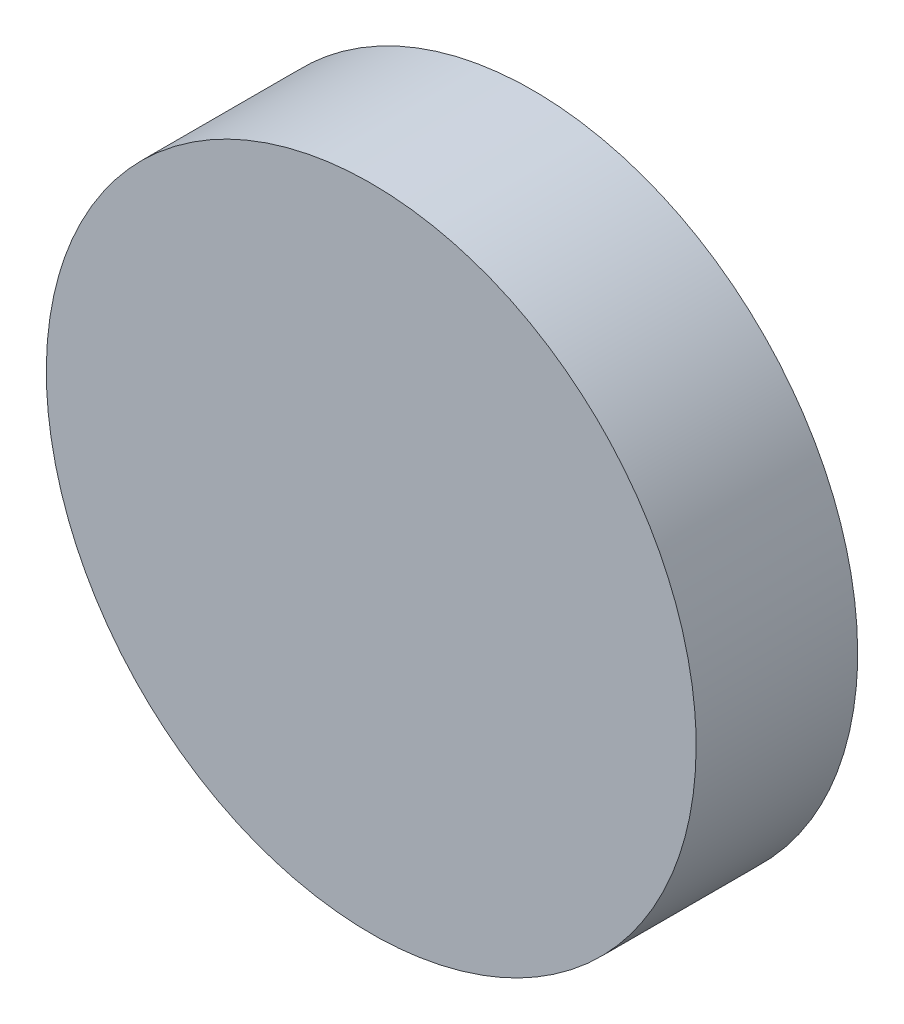
ISO-10303-21;
HEADER;
FILE_DESCRIPTION(('STEP AP214'),'2;1');
FILE_NAME('part.step','',(''),(''),'','','');
FILE_SCHEMA(('AUTOMOTIVE_DESIGN { 1 0 10303 214 1 1 1 1 }'));
ENDSEC;
DATA;
#1=APPLICATION_CONTEXT('core data for automotive mechanical design processes');
#2=APPLICATION_PROTOCOL_DEFINITION('international standard','automotive_design',2000,#1);
#3=PRODUCT_CONTEXT('',#1,'mechanical');
#4=PRODUCT('Part','Part','',(#3));
#5=PRODUCT_RELATED_PRODUCT_CATEGORY('part','',(#4));
#6=PRODUCT_DEFINITION_FORMATION('','',#4);
#7=PRODUCT_DEFINITION_CONTEXT('part definition',#1,'design');
#8=PRODUCT_DEFINITION('design','',#6,#7);
#9=PRODUCT_DEFINITION_SHAPE('','',#8);
#10=(LENGTH_UNIT() NAMED_UNIT(*) SI_UNIT(.MILLI.,.METRE.));
#11=(NAMED_UNIT(*) PLANE_ANGLE_UNIT() SI_UNIT($,.RADIAN.));
#12=(NAMED_UNIT(*) SI_UNIT($,.STERADIAN.) SOLID_ANGLE_UNIT());
#13=UNCERTAINTY_MEASURE_WITH_UNIT(LENGTH_MEASURE(1.E-05),#10,'distance_accuracy_value','');
#14=(GEOMETRIC_REPRESENTATION_CONTEXT(3) GLOBAL_UNCERTAINTY_ASSIGNED_CONTEXT((#13)) GLOBAL_UNIT_ASSIGNED_CONTEXT((#10,
#11,#12)) REPRESENTATION_CONTEXT('',''));
#15=CARTESIAN_POINT('',(0.,0.,0.));
#16=DIRECTION('',(0.,0.,1.));
#17=DIRECTION('',(1.,0.,0.));
#18=AXIS2_PLACEMENT_3D('',#15,#16,#17);
#19=CARTESIAN_POINT('',(15.3503636056791,-25.6015554934087,33.9766497664763));
#20=CARTESIAN_POINT('',(15.3503636056791,-25.3323875266763,33.9766497664763));
#21=CARTESIAN_POINT('',(15.2432819307081,-24.7940515932114,33.9766497664762));
#22=CARTESIAN_POINT('',(14.7858677148132,-24.109482841778,33.9766497664763));
#23=CARTESIAN_POINT('',(14.1012989633798,-23.6520686258831,33.9766497664763));
#24=CARTESIAN_POINT('',(13.2937950631825,-23.4914461134265,33.9766497664763));
#25=CARTESIAN_POINT('',(12.4862911629851,-23.6520686258831,33.9766497664763));
#26=CARTESIAN_POINT('',(11.8017224115517,-24.109482841778,33.9766497664763));
#27=CARTESIAN_POINT('',(11.3443081956568,-24.7940515932114,33.9766497664763));
#28=CARTESIAN_POINT('',(11.1836856832003,-25.6015554934087,33.9766497664763));
#29=CARTESIAN_POINT('',(11.3443081956568,-26.4090593936061,33.9766497664763));
#30=CARTESIAN_POINT('',(11.8017224115517,-27.0936281450395,33.9766497664763));
#31=CARTESIAN_POINT('',(12.4862911629851,-27.5510423609344,33.9766497664763));
#32=CARTESIAN_POINT('',(13.2937950631825,-27.7116648733909,33.9766497664763));
#33=CARTESIAN_POINT('',(14.1012989633798,-27.5510423609344,33.9766497664763));
#34=CARTESIAN_POINT('',(14.7858677148132,-27.0936281450395,33.9766497664763));
#35=CARTESIAN_POINT('',(15.2432819307081,-26.4090593936061,33.9766497664763));
#36=CARTESIAN_POINT('',(15.3503636056791,-25.8707234601412,33.9766497664763));
#37=CARTESIAN_POINT('',(15.3503636056791,-25.6015554934087,33.9766497664763));
#38=B_SPLINE_CURVE_WITH_KNOTS('',3,(#19,#20,#21,#22,#23,#24,#25,#26,#27,#28,#29,#30,#31,#32,#33,
#34,#35,#36,#37),.UNSPECIFIED.,.T.,.F.,(4,1,1,1,1,1,1,1,1,1,1,1,1,1,1,1,4),(0.,0.0625,0.125,
0.1875,0.25,0.3125,0.375,0.4375,0.5,0.5625,0.625,0.6875,0.75,0.8125,0.875,0.9375,1.),.UNSPECIFIED.);
#39=DIRECTION('',(0.,0.,1.));
#40=VECTOR('',#39,1.);
#41=SURFACE_OF_LINEAR_EXTRUSION('',#38,#40);
#42=CARTESIAN_POINT('',(15.3503636056791,-25.6015554934087,33.9766497664763));
#43=CARTESIAN_POINT('',(15.3503636056791,-25.3323875266763,33.9766497664763));
#44=CARTESIAN_POINT('',(15.2432819307081,-24.7940515932114,33.9766497664763));
#45=CARTESIAN_POINT('',(14.7858677148132,-24.109482841778,33.9766497664763));
#46=CARTESIAN_POINT('',(14.1012989633798,-23.6520686258831,33.9766497664763));
#47=CARTESIAN_POINT('',(13.2937950631825,-23.4914461134265,33.9766497664763));
#48=CARTESIAN_POINT('',(12.4862911629851,-23.6520686258831,33.9766497664763));
#49=CARTESIAN_POINT('',(11.8017224115517,-24.109482841778,33.9766497664763));
#50=CARTESIAN_POINT('',(11.3443081956568,-24.7940515932114,33.9766497664763));
#51=CARTESIAN_POINT('',(11.1836856832003,-25.6015554934087,33.9766497664763));
#52=CARTESIAN_POINT('',(11.3443081956568,-26.4090593936061,33.9766497664763));
#53=CARTESIAN_POINT('',(11.8017224115517,-27.0936281450395,33.9766497664763));
#54=CARTESIAN_POINT('',(12.4862911629851,-27.5510423609344,33.9766497664763));
#55=CARTESIAN_POINT('',(13.2937950631825,-27.7116648733909,33.9766497664763));
#56=CARTESIAN_POINT('',(14.1012989633798,-27.5510423609344,33.9766497664763));
#57=CARTESIAN_POINT('',(14.7858677148132,-27.0936281450395,33.9766497664763));
#58=CARTESIAN_POINT('',(15.2432819307081,-26.4090593936061,33.9766497664763));
#59=CARTESIAN_POINT('',(15.3503636056791,-25.8707234601412,33.9766497664763));
#60=CARTESIAN_POINT('',(15.3503636056791,-25.6015554934087,33.9766497664763));
#61=B_SPLINE_CURVE_WITH_KNOTS('',3,(#42,#43,#44,#45,#46,#47,#48,#49,#50,#51,#52,#53,#54,#55,#56,
#57,#58,#59,#60),.UNSPECIFIED.,.T.,.F.,(4,1,1,1,1,1,1,1,1,1,1,1,1,1,1,1,4),(0.,0.0625,0.125,
0.1875,0.25,0.3125,0.375,0.4375,0.5,0.5625,0.625,0.6875,0.75,0.8125,0.875,0.9375,1.),.UNSPECIFIED.);
#62=CARTESIAN_POINT('',(15.3503636056791,-25.6015554934087,33.9766497664763));
#63=VERTEX_POINT('',#62);
#64=EDGE_CURVE('E9',#63,#63,#61,.T.);
#65=ORIENTED_EDGE('',*,*,#64,.T.);
#66=EDGE_LOOP('',(#65));
#67=FACE_BOUND('',#66,.T.);
#68=CARTESIAN_POINT('',(15.3503636056791,-25.6015554934087,34.9990000000068));
#69=CARTESIAN_POINT('',(15.3503636300379,-25.6352022831517,34.9990000000068));
#70=CARTESIAN_POINT('',(15.3495269935284,-25.6688483745142,34.9990000000068));
#71=CARTESIAN_POINT('',(15.346196586481,-25.7360605285312,34.9990000000068));
#72=CARTESIAN_POINT('',(15.3437027184522,-25.7696265863609,34.9990000000068));
#73=CARTESIAN_POINT('',(15.3370738124356,-25.8365983613763,34.9990000000068));
#74=CARTESIAN_POINT('',(15.3329386618263,-25.8700040673998,34.9990000000068));
#75=CARTESIAN_POINT('',(15.323043098035,-25.9365753108456,34.9990000000068));
#76=CARTESIAN_POINT('',(15.3172826147575,-25.9697408378466,34.9990000000068));
#77=CARTESIAN_POINT('',(15.3041522287672,-26.0357517513031,34.9990000000068));
#78=CARTESIAN_POINT('',(15.2967823260544,-26.0685971377587,34.9990000000068));
#79=CARTESIAN_POINT('',(15.2804489160935,-26.1338878282125,34.9990000000068));
#80=CARTESIAN_POINT('',(15.2714854775938,-26.1663331494057,34.9990000000068));
#81=CARTESIAN_POINT('',(15.2519808248614,-26.2307437222432,34.9990000000068));
#82=CARTESIAN_POINT('',(15.241439718946,-26.2627090066795,34.9990000000068));
#83=CARTESIAN_POINT('',(15.218795541295,-26.3260796262804,34.9990000000068));
#84=CARTESIAN_POINT('',(15.2066925614854,-26.3574849942758,34.9990000000068));
#85=CARTESIAN_POINT('',(15.180940732118,-26.4196554100151,34.9990000000068));
#86=CARTESIAN_POINT('',(15.1672918825602,-26.4504204577589,34.9990000000068));
#87=CARTESIAN_POINT('',(15.1384939392235,-26.5112421042255,34.9990000000068));
#88=CARTESIAN_POINT('',(15.1233447572282,-26.5412986611616,34.9990000000068));
#89=CARTESIAN_POINT('',(15.0915914768304,-26.6006356860102,34.9990000000068));
#90=CARTESIAN_POINT('',(15.0749872786485,-26.6299161005181,34.9990000000068));
#91=CARTESIAN_POINT('',(15.0403692527882,-26.6876330561693,34.9990000000068));
#92=CARTESIAN_POINT('',(15.0223553643385,-26.716069560859,34.9990000000068));
#93=CARTESIAN_POINT('',(14.9849631878921,-26.7720309076073,34.9990000000068));
#94=CARTESIAN_POINT('',(14.9655848998955,-26.799555749666,34.9990000000068));
#95=CARTESIAN_POINT('',(14.925509130848,-26.8536259579087,34.9990000000068));
#96=CARTESIAN_POINT('',(14.9048117067321,-26.8801713662879,34.9990000000068));
#97=CARTESIAN_POINT('',(14.8621428982873,-26.9322148684723,34.9990000000068));
#98=CARTESIAN_POINT('',(14.8401716014817,-26.9577130340248,34.9990000000068));
#99=CARTESIAN_POINT('',(14.7950002229733,-27.0075943008858,34.9990000000068));
#100=CARTESIAN_POINT('',(14.7718002136353,-27.0319774677046,34.9990000000068));
#101=CARTESIAN_POINT('',(14.7242170374783,-27.0795606438615,34.9990000000068));
#102=CARTESIAN_POINT('',(14.6998338706595,-27.1027606531996,34.9990000000068));
#103=CARTESIAN_POINT('',(14.6499526037985,-27.147932031708,34.9990000000068));
#104=CARTESIAN_POINT('',(14.624454438246,-27.1699033285136,34.9990000000068));
#105=CARTESIAN_POINT('',(14.5724109360616,-27.2125721369584,34.9990000000068));
#106=CARTESIAN_POINT('',(14.5458655276824,-27.2332695610743,34.9990000000068));
#107=CARTESIAN_POINT('',(14.4917953194397,-27.2733453301218,34.9990000000068));
#108=CARTESIAN_POINT('',(14.464270477381,-27.2927236181184,34.9990000000068));
#109=CARTESIAN_POINT('',(14.4083091306328,-27.3301157945648,34.9990000000068));
#110=CARTESIAN_POINT('',(14.3798726259432,-27.3481296830145,34.9990000000068));
#111=CARTESIAN_POINT('',(14.3221556702916,-27.3827477088748,34.9990000000068));
#112=CARTESIAN_POINT('',(14.2928752557831,-27.3993519070567,34.9990000000068));
#113=CARTESIAN_POINT('',(14.2335382309361,-27.4311051874545,34.9990000000068));
#114=CARTESIAN_POINT('',(14.2034816740021,-27.4462543694499,34.9990000000068));
#115=CARTESIAN_POINT('',(14.1426600275298,-27.4750523127863,34.9990000000068));
#116=CARTESIAN_POINT('',(14.1118949797781,-27.4887011623436,34.9990000000068));
#117=CARTESIAN_POINT('',(14.0497245640602,-27.5144529917123,34.9990000000068));
#118=CARTESIAN_POINT('',(14.0183191960941,-27.5265559715237,34.9990000000068));
#119=CARTESIAN_POINT('',(13.9549485764132,-27.5492001491698,34.9990000000068));
#120=CARTESIAN_POINT('',(13.9229832918677,-27.5597412550786,34.9990000000068));
#121=CARTESIAN_POINT('',(13.8585727193287,-27.5792459078291,34.9990000000068));
#122=CARTESIAN_POINT('',(13.8261273985432,-27.5882093463535,34.9990000000068));
#123=CARTESIAN_POINT('',(13.7608367069754,-27.604542756247,34.9990000000068));
#124=CARTESIAN_POINT('',(13.7279913189978,-27.6119126588679,34.9990000000068));
#125=CARTESIAN_POINT('',(13.6619804096993,-27.6250430451094,34.9990000000068));
#126=CARTESIAN_POINT('',(13.6288148883783,-27.63080352873,34.9990000000068));
#127=CARTESIAN_POINT('',(13.5622436294149,-27.6406990915838,34.9990000000068));
#128=CARTESIAN_POINT('',(13.5288379021952,-27.6448342409127,34.9990000000068));
#129=CARTESIAN_POINT('',(13.4618661850874,-27.6514631504275,34.9990000000068));
#130=CARTESIAN_POINT('',(13.4283002063548,-27.6539570232348,34.9990000000068));
#131=CARTESIAN_POINT('',(13.3610878362444,-27.6572874172275,34.9990000000068));
#132=CARTESIAN_POINT('',(13.3274414497134,-27.6581240359054,34.9990000000068));
#133=CARTESIAN_POINT('',(13.2601486766515,-27.6581240359054,34.9990000000068));
#134=CARTESIAN_POINT('',(13.2265022901205,-27.6572874172276,34.9990000000068));
#135=CARTESIAN_POINT('',(13.1592899200101,-27.6539570232348,34.9990000000068));
#136=CARTESIAN_POINT('',(13.1257239412775,-27.6514631504275,34.9990000000068));
#137=CARTESIAN_POINT('',(13.0587522241697,-27.6448342409127,34.9990000000068));
#138=CARTESIAN_POINT('',(13.02534649695,-27.6406990915838,34.9990000000068));
#139=CARTESIAN_POINT('',(12.9587752379866,-27.63080352873,34.9990000000068));
#140=CARTESIAN_POINT('',(12.9256097166656,-27.6250430451094,34.9990000000068));
#141=CARTESIAN_POINT('',(12.8595988073671,-27.6119126588679,34.9990000000068));
#142=CARTESIAN_POINT('',(12.8267534193895,-27.604542756247,34.9990000000068));
#143=CARTESIAN_POINT('',(12.7614627278217,-27.5882093463535,34.9990000000068));
#144=CARTESIAN_POINT('',(12.7290174070362,-27.5792459078291,34.9990000000068));
#145=CARTESIAN_POINT('',(12.6646068344972,-27.5597412550786,34.9990000000068));
#146=CARTESIAN_POINT('',(12.6326415499517,-27.5492001491698,34.9990000000068));
#147=CARTESIAN_POINT('',(12.5692709302708,-27.5265559715237,34.9990000000068));
#148=CARTESIAN_POINT('',(12.5378655623047,-27.5144529917123,34.9990000000068));
#149=CARTESIAN_POINT('',(12.4756951465868,-27.4887011623436,34.9990000000068));
#150=CARTESIAN_POINT('',(12.4449300988351,-27.4750523127863,34.9990000000068));
#151=CARTESIAN_POINT('',(12.3841084523628,-27.4462543694499,34.9990000000068));
#152=CARTESIAN_POINT('',(12.3540518954288,-27.4311051874545,34.9990000000068));
#153=CARTESIAN_POINT('',(12.2947148705818,-27.3993519070567,34.9990000000068));
#154=CARTESIAN_POINT('',(12.2654344560733,-27.3827477088748,34.9990000000068));
#155=CARTESIAN_POINT('',(12.2077175004217,-27.3481296830145,34.9990000000068));
#156=CARTESIAN_POINT('',(12.1792809957321,-27.3301157945648,34.9990000000068));
#157=CARTESIAN_POINT('',(12.1233196489839,-27.2927236181184,34.9990000000068));
#158=CARTESIAN_POINT('',(12.0957948069252,-27.2733453301217,34.9990000000068));
#159=CARTESIAN_POINT('',(12.0417245986825,-27.2332695610743,34.9990000000068));
#160=CARTESIAN_POINT('',(12.0151791903033,-27.2125721369584,34.9990000000068));
#161=CARTESIAN_POINT('',(11.9631356881189,-27.1699033285136,34.9990000000068));
#162=CARTESIAN_POINT('',(11.9376375225664,-27.147932031708,34.9990000000068));
#163=CARTESIAN_POINT('',(11.8877562557054,-27.1027606531996,34.9990000000068));
#164=CARTESIAN_POINT('',(11.8633730888866,-27.0795606438615,34.9990000000068));
#165=CARTESIAN_POINT('',(11.8157899127297,-27.0319774677046,34.9990000000068));
#166=CARTESIAN_POINT('',(11.7925899033916,-27.0075943008857,34.9990000000068));
#167=CARTESIAN_POINT('',(11.7474185248832,-26.9577130340248,34.9990000000068));
#168=CARTESIAN_POINT('',(11.7254472280776,-26.9322148684723,34.9990000000068));
#169=CARTESIAN_POINT('',(11.6827784196328,-26.8801713662879,34.9990000000068));
#170=CARTESIAN_POINT('',(11.6620809955169,-26.8536259579087,34.9990000000068));
#171=CARTESIAN_POINT('',(11.6220052264694,-26.799555749666,34.9990000000068));
#172=CARTESIAN_POINT('',(11.6026269384728,-26.7720309076073,34.9990000000068));
#173=CARTESIAN_POINT('',(11.5652347620264,-26.716069560859,34.9990000000068));
#174=CARTESIAN_POINT('',(11.5472208735767,-26.6876330561695,34.9990000000068));
#175=CARTESIAN_POINT('',(11.5126028477164,-26.6299161005179,34.9990000000068));
#176=CARTESIAN_POINT('',(11.4959986495345,-26.6006356860094,34.9990000000068));
#177=CARTESIAN_POINT('',(11.4642453691367,-26.5412986611624,34.9990000000068));
#178=CARTESIAN_POINT('',(11.4490961871413,-26.5112421042283,34.9990000000068));
#179=CARTESIAN_POINT('',(11.4202982438049,-26.450420457756,34.9990000000068));
#180=CARTESIAN_POINT('',(11.4066493942476,-26.4196554100043,34.9990000000068));
#181=CARTESIAN_POINT('',(11.3808975648789,-26.3574849942865,34.9990000000068));
#182=CARTESIAN_POINT('',(11.3687945850675,-26.3260796263204,34.9990000000068));
#183=CARTESIAN_POINT('',(11.3461504074214,-26.2627090066395,34.9990000000068));
#184=CARTESIAN_POINT('',(11.3356093015126,-26.2307437220939,34.9990000000068));
#185=CARTESIAN_POINT('',(11.316104648762,-26.1663331495549,34.9990000000068));
#186=CARTESIAN_POINT('',(11.3071412102377,-26.1338878287695,34.9990000000068));
#187=CARTESIAN_POINT('',(11.2908078003441,-26.0685971372016,34.9990000000068));
#188=CARTESIAN_POINT('',(11.2834378977233,-26.0357517492241,34.9990000000068));
#189=CARTESIAN_POINT('',(11.2703075114818,-25.9697408399255,34.9990000000068));
#190=CARTESIAN_POINT('',(11.2645470278612,-25.9365753186046,34.9990000000068));
#191=CARTESIAN_POINT('',(11.2546514650073,-25.8700040596412,34.9990000000068));
#192=CARTESIAN_POINT('',(11.2505163156785,-25.8365983324215,34.9990000000068));
#193=CARTESIAN_POINT('',(11.2438874061636,-25.7696266153137,34.9990000000068));
#194=CARTESIAN_POINT('',(11.2413935333564,-25.7360606365811,34.9990000000068));
#195=CARTESIAN_POINT('',(11.2380631393636,-25.6688482664707,34.9990000000068));
#196=CARTESIAN_POINT('',(11.2372265206858,-25.6352018799397,34.9990000000068));
#197=CARTESIAN_POINT('',(11.2372265206858,-25.5679091068778,34.9990000000068));
#198=CARTESIAN_POINT('',(11.2380631393636,-25.5342627203468,34.9990000000068));
#199=CARTESIAN_POINT('',(11.2413935333564,-25.4670503502364,34.9990000000068));
#200=CARTESIAN_POINT('',(11.2438874061636,-25.4334843715037,34.9990000000068));
#201=CARTESIAN_POINT('',(11.2505163156785,-25.366512654396,34.9990000000068));
#202=CARTESIAN_POINT('',(11.2546514650073,-25.3331069271762,34.9990000000068));
#203=CARTESIAN_POINT('',(11.2645470278612,-25.2665356682129,34.9990000000068));
#204=CARTESIAN_POINT('',(11.2703075114818,-25.2333701468919,34.9990000000068));
#205=CARTESIAN_POINT('',(11.2834378977233,-25.1673592375934,34.9990000000068));
#206=CARTESIAN_POINT('',(11.2908078003441,-25.1345138496158,34.9990000000068));
#207=CARTESIAN_POINT('',(11.3071412102377,-25.069223158048,34.9990000000068));
#208=CARTESIAN_POINT('',(11.316104648762,-25.0367778372625,34.9990000000068));
#209=CARTESIAN_POINT('',(11.3356093015126,-24.9723672647235,34.9990000000068));
#210=CARTESIAN_POINT('',(11.3461504074214,-24.940401980178,34.9990000000068));
#211=CARTESIAN_POINT('',(11.3687945850675,-24.8770313604971,34.9990000000068));
#212=CARTESIAN_POINT('',(11.3808975648789,-24.845625992531,34.9990000000068));
#213=CARTESIAN_POINT('',(11.4066493942476,-24.7834555768131,34.9990000000068));
#214=CARTESIAN_POINT('',(11.4202982438049,-24.7526905290614,34.9990000000068));
#215=CARTESIAN_POINT('',(11.4490961871413,-24.6918688825891,34.9990000000068));
#216=CARTESIAN_POINT('',(11.4642453691367,-24.6618123256551,34.9990000000068));
#217=CARTESIAN_POINT('',(11.4959986495345,-24.6024753008081,34.9990000000068));
#218=CARTESIAN_POINT('',(11.5126028477164,-24.5731948862996,34.9990000000068));
#219=CARTESIAN_POINT('',(11.5472208735767,-24.515477930648,34.9990000000068));
#220=CARTESIAN_POINT('',(11.5652347620264,-24.4870414259584,34.9990000000068));
#221=CARTESIAN_POINT('',(11.6026269384728,-24.4310800792102,34.9990000000068));
#222=CARTESIAN_POINT('',(11.6220052264694,-24.4035552371515,34.9990000000068));
#223=CARTESIAN_POINT('',(11.6620809955169,-24.3494850289088,34.9990000000068));
#224=CARTESIAN_POINT('',(11.6827784196328,-24.3229396205296,34.9990000000068));
#225=CARTESIAN_POINT('',(11.7254472280776,-24.2708961183452,34.9990000000068));
#226=CARTESIAN_POINT('',(11.7474185248832,-24.2453979527927,34.9990000000068));
#227=CARTESIAN_POINT('',(11.7925899033916,-24.1955166859317,34.9990000000068));
#228=CARTESIAN_POINT('',(11.8157899127297,-24.1711335191129,34.9990000000068));
#229=CARTESIAN_POINT('',(11.8633730888866,-24.1235503429559,34.9990000000068));
#230=CARTESIAN_POINT('',(11.8877562557054,-24.1003503336178,34.9990000000068));
#231=CARTESIAN_POINT('',(11.9376375225664,-24.0551789551095,34.9990000000068));
#232=CARTESIAN_POINT('',(11.9631356881189,-24.0332076583039,34.9990000000068));
#233=CARTESIAN_POINT('',(12.0151791903033,-23.9905388498591,34.9990000000068));
#234=CARTESIAN_POINT('',(12.0417245986825,-23.9698414257432,34.9990000000068));
#235=CARTESIAN_POINT('',(12.0957948069252,-23.9297656566957,34.9990000000068));
#236=CARTESIAN_POINT('',(12.1233196489839,-23.9103873686991,34.9990000000068));
#237=CARTESIAN_POINT('',(12.1792809957321,-23.8729951922527,34.9990000000068));
#238=CARTESIAN_POINT('',(12.2077175004217,-23.854981303803,34.9990000000068));
#239=CARTESIAN_POINT('',(12.2654344560733,-23.8203632779427,34.9990000000068));
#240=CARTESIAN_POINT('',(12.2947148705818,-23.8037590797608,34.9990000000068));
#241=CARTESIAN_POINT('',(12.3540518954288,-23.7720057993629,34.9990000000068));
#242=CARTESIAN_POINT('',(12.3841084523628,-23.7568566173675,34.9990000000068));
#243=CARTESIAN_POINT('',(12.4449300988351,-23.7280586740312,34.9990000000068));
#244=CARTESIAN_POINT('',(12.4756951465868,-23.7144098244738,34.9990000000068));
#245=CARTESIAN_POINT('',(12.5378655623047,-23.6886579951051,34.9990000000068));
#246=CARTESIAN_POINT('',(12.5692709302708,-23.6765550152938,34.9990000000068));
#247=CARTESIAN_POINT('',(12.6326415499517,-23.6539108376476,34.9990000000068));
#248=CARTESIAN_POINT('',(12.6646068344973,-23.6433697317388,34.9990000000068));
#249=CARTESIAN_POINT('',(12.7290174070362,-23.6238650789883,34.9990000000068));
#250=CARTESIAN_POINT('',(12.7614627278217,-23.614901640464,34.9990000000068));
#251=CARTESIAN_POINT('',(12.8267534193895,-23.5985682305704,34.9990000000068));
#252=CARTESIAN_POINT('',(12.8595988073671,-23.5911983279495,34.9990000000068));
#253=CARTESIAN_POINT('',(12.9256097166656,-23.5780679417081,34.9990000000068));
#254=CARTESIAN_POINT('',(12.9587752379866,-23.5723074580875,34.9990000000068));
#255=CARTESIAN_POINT('',(13.02534649695,-23.5624118952336,34.9990000000068));
#256=CARTESIAN_POINT('',(13.0587522241697,-23.5582767459048,34.9990000000068));
#257=CARTESIAN_POINT('',(13.1257239412775,-23.5516478363899,34.9990000000068));
#258=CARTESIAN_POINT('',(13.1592899200101,-23.5491539635827,34.9990000000068));
#259=CARTESIAN_POINT('',(13.2265022901205,-23.5458235695899,34.9990000000068));
#260=CARTESIAN_POINT('',(13.2601486766515,-23.5449869509121,34.9990000000068));
#261=CARTESIAN_POINT('',(13.3274414497134,-23.5449869509121,34.9990000000068));
#262=CARTESIAN_POINT('',(13.3610878362444,-23.5458235695899,34.9990000000068));
#263=CARTESIAN_POINT('',(13.4283002063548,-23.5491539635827,34.9990000000068));
#264=CARTESIAN_POINT('',(13.4618661850874,-23.5516478363899,34.9990000000068));
#265=CARTESIAN_POINT('',(13.5288379021952,-23.5582767459048,34.9990000000068));
#266=CARTESIAN_POINT('',(13.5622436294149,-23.5624118952336,34.9990000000068));
#267=CARTESIAN_POINT('',(13.6288148883783,-23.5723074580875,34.9990000000068));
#268=CARTESIAN_POINT('',(13.6619804096993,-23.5780679417081,34.9990000000068));
#269=CARTESIAN_POINT('',(13.7279913189978,-23.5911983279495,34.9990000000068));
#270=CARTESIAN_POINT('',(13.7608367069754,-23.5985682305704,34.9990000000068));
#271=CARTESIAN_POINT('',(13.8261273985432,-23.614901640464,34.9990000000068));
#272=CARTESIAN_POINT('',(13.8585727193287,-23.6238650789883,34.9990000000068));
#273=CARTESIAN_POINT('',(13.9229832918677,-23.6433697317388,34.9990000000068));
#274=CARTESIAN_POINT('',(13.9549485764132,-23.6539108376476,34.9990000000068));
#275=CARTESIAN_POINT('',(14.0183191960941,-23.6765550152938,34.9990000000068));
#276=CARTESIAN_POINT('',(14.0497245640602,-23.6886579951051,34.9990000000068));
#277=CARTESIAN_POINT('',(14.1118949797781,-23.7144098244738,34.9990000000068));
#278=CARTESIAN_POINT('',(14.1426600275298,-23.7280586740312,34.9990000000068));
#279=CARTESIAN_POINT('',(14.2034816740021,-23.7568566173675,34.9990000000068));
#280=CARTESIAN_POINT('',(14.2335382309361,-23.7720057993629,34.9990000000068));
#281=CARTESIAN_POINT('',(14.2928752557831,-23.8037590797608,34.9990000000068));
#282=CARTESIAN_POINT('',(14.3221556702916,-23.8203632779427,34.9990000000068));
#283=CARTESIAN_POINT('',(14.3798726259432,-23.854981303803,34.9990000000068));
#284=CARTESIAN_POINT('',(14.4083091306328,-23.8729951922527,34.9990000000068));
#285=CARTESIAN_POINT('',(14.464270477381,-23.9103873686991,34.9990000000068));
#286=CARTESIAN_POINT('',(14.4917953194397,-23.9297656566957,34.9990000000068));
#287=CARTESIAN_POINT('',(14.5458655276824,-23.9698414257432,34.9990000000068));
#288=CARTESIAN_POINT('',(14.5724109360616,-23.9905388498591,34.9990000000068));
#289=CARTESIAN_POINT('',(14.624454438246,-24.0332076583039,34.9990000000068));
#290=CARTESIAN_POINT('',(14.6499526037985,-24.0551789551095,34.9990000000068));
#291=CARTESIAN_POINT('',(14.6998338706595,-24.1003503336179,34.9990000000068));
#292=CARTESIAN_POINT('',(14.7242170374783,-24.1235503429559,34.9990000000068));
#293=CARTESIAN_POINT('',(14.7718002136353,-24.1711335191129,34.9990000000068));
#294=CARTESIAN_POINT('',(14.7950002229733,-24.1955166859317,34.9990000000068));
#295=CARTESIAN_POINT('',(14.8401716014817,-24.2453979527927,34.9990000000068));
#296=CARTESIAN_POINT('',(14.8621428982873,-24.2708961183452,34.9990000000068));
#297=CARTESIAN_POINT('',(14.9048117067321,-24.3229396205296,34.9990000000068));
#298=CARTESIAN_POINT('',(14.925509130848,-24.3494850289088,34.9990000000068));
#299=CARTESIAN_POINT('',(14.9655848998955,-24.4035552371515,34.9990000000068));
#300=CARTESIAN_POINT('',(14.9849631878921,-24.4310800792102,34.9990000000068));
#301=CARTESIAN_POINT('',(15.0223553643385,-24.4870414259585,34.9990000000068));
#302=CARTESIAN_POINT('',(15.0403692527882,-24.5154779306482,34.9990000000068));
#303=CARTESIAN_POINT('',(15.0749872786485,-24.5731948862994,34.9990000000068));
#304=CARTESIAN_POINT('',(15.0915914768304,-24.6024753008073,34.9990000000068));
#305=CARTESIAN_POINT('',(15.1233447572282,-24.6618123256558,34.9990000000068));
#306=CARTESIAN_POINT('',(15.1384939392235,-24.691868882592,34.9990000000068));
#307=CARTESIAN_POINT('',(15.1672918825602,-24.7526905290586,34.9990000000068));
#308=CARTESIAN_POINT('',(15.180940732118,-24.7834555768024,34.9990000000068));
#309=CARTESIAN_POINT('',(15.2066925614854,-24.8456259925417,34.9990000000068));
#310=CARTESIAN_POINT('',(15.218795541295,-24.8770313605371,34.9990000000068));
#311=CARTESIAN_POINT('',(15.241439718946,-24.940401980138,34.9990000000068));
#312=CARTESIAN_POINT('',(15.2519808248614,-24.9723672645743,34.9990000000068));
#313=CARTESIAN_POINT('',(15.2714854775939,-25.0367778374118,34.9990000000068));
#314=CARTESIAN_POINT('',(15.2804489160935,-25.069223158605,34.9990000000068));
#315=CARTESIAN_POINT('',(15.2967823260544,-25.1345138490588,34.9990000000068));
#316=CARTESIAN_POINT('',(15.3041522287672,-25.1673592355144,34.9990000000068));
#317=CARTESIAN_POINT('',(15.3172826147575,-25.2333701489709,34.9990000000068));
#318=CARTESIAN_POINT('',(15.323043098035,-25.2665356759718,34.9990000000068));
#319=CARTESIAN_POINT('',(15.3329386618263,-25.3331069194177,34.9990000000068));
#320=CARTESIAN_POINT('',(15.3370738124356,-25.3665126254411,34.9990000000068));
#321=CARTESIAN_POINT('',(15.3437027184522,-25.4334844004566,34.9990000000068));
#322=CARTESIAN_POINT('',(15.346196586481,-25.4670504582863,34.9990000000068));
#323=CARTESIAN_POINT('',(15.3495269935284,-25.5342626123033,34.9990000000068));
#324=CARTESIAN_POINT('',(15.3503636300379,-25.5679087036658,34.9990000000068));
#325=CARTESIAN_POINT('',(15.3503636056791,-25.6015554934087,34.9990000000068));
#326=B_SPLINE_CURVE_WITH_KNOTS('',3,(#68,#69,#70,#71,#72,#73,#74,#75,#76,#77,#78,#79,#80,#81,
#82,#83,#84,#85,#86,#87,#88,#89,#90,#91,#92,#93,#94,#95,#96,#97,#98,#99,#100,#101,#102,#103,
#104,#105,#106,#107,#108,#109,#110,#111,#112,#113,#114,#115,#116,#117,#118,#119,#120,#121,#122,
#123,#124,#125,#126,#127,#128,#129,#130,#131,#132,#133,#134,#135,#136,#137,#138,#139,#140,#141,
#142,#143,#144,#145,#146,#147,#148,#149,#150,#151,#152,#153,#154,#155,#156,#157,#158,#159,#160,
#161,#162,#163,#164,#165,#166,#167,#168,#169,#170,#171,#172,#173,#174,#175,#176,#177,#178,#179,
#180,#181,#182,#183,#184,#185,#186,#187,#188,#189,#190,#191,#192,#193,#194,#195,#196,#197,#198,
#199,#200,#201,#202,#203,#204,#205,#206,#207,#208,#209,#210,#211,#212,#213,#214,#215,#216,#217,
#218,#219,#220,#221,#222,#223,#224,#225,#226,#227,#228,#229,#230,#231,#232,#233,#234,#235,#236,
#237,#238,#239,#240,#241,#242,#243,#244,#245,#246,#247,#248,#249,#250,#251,#252,#253,#254,#255,
#256,#257,#258,#259,#260,#261,#262,#263,#264,#265,#266,#267,#268,#269,#270,#271,#272,#273,#274,
#275,#276,#277,#278,#279,#280,#281,#282,#283,#284,#285,#286,#287,#288,#289,#290,#291,#292,#293,
#294,#295,#296,#297,#298,#299,#300,#301,#302,#303,#304,#305,#306,#307,#308,#309,#310,#311,#312,
#313,#314,#315,#316,#317,#318,#319,#320,#321,#322,#323,#324,#325),.UNSPECIFIED.,.F.,.F.,(4,2,2,
2,2,2,2,2,2,2,2,2,2,2,2,2,2,2,2,2,2,2,2,2,2,2,2,2,2,2,2,2,2,2,2,2,2,2,2,2,2,2,2,2,2,2,2,2,2,2,2,
2,2,2,2,2,2,2,2,2,2,2,2,2,2,2,2,2,2,2,2,2,2,2,2,2,2,2,2,2,2,2,2,2,2,2,2,2,2,2,2,2,2,2,2,2,2,2,2,
2,2,2,2,2,2,2,2,2,2,2,2,2,2,2,2,2,2,2,2,2,2,2,2,2,2,2,2,2,4),(0.,0.100928980478605,
0.201863898895517,0.302805744465613,0.403751944002993,0.504698143540366,0.605639989110463,
0.706574907527376,0.807503888005986,0.908432868484591,1.0093677869015,1.1103096324716,
1.21125583200898,1.31220203154635,1.41314387711645,1.51407879553335,1.61500777601197,
1.71593675649058,1.81687167490748,1.91781352047758,2.01875972001495,2.11970591955233,
2.22064776512243,2.32158268353934,2.42251166401795,2.52344064449656,2.62437556291346,
2.72531740848356,2.82626360802094,2.92720980755831,3.02815165312841,3.12908657154532,
3.23001555202393,3.33094453250254,3.43187945091944,3.53282129648954,3.63376749602692,
3.73471369556429,3.83565554113439,3.93659045955129,4.03751944002991,4.13844842050852,
4.23938333892542,4.34032518449552,4.4412713840329,4.54221758357028,4.64315942914038,
4.74409434755728,4.84502332803589,4.94595230851451,5.04688722693141,5.14782907250151,
5.24877527203889,5.34972147157627,5.45066331714636,5.55159823556327,5.65252721604188,
5.75345619652049,5.85439111493739,5.95533296050749,6.05627916004487,6.15722535958224,
6.25816720515234,6.35910212356925,6.46003110404786,6.56096008452646,6.66189500294337,
6.76283684851348,6.86378304805085,6.96472924758822,7.06567109315832,7.16660601157523,
7.26753499205384,7.36846397253245,7.46939889094935,7.57034073651946,7.67128693605683,
7.77223313559421,7.87317498116431,7.97410989958121,8.07503888005983,8.17596786053844,
8.27690277895534,8.37784462452544,8.47879082406281,8.57973702360019,8.68067886917029,
8.7816137875872,8.88254276806581,8.98347174854442,9.08440666696132,9.18534851253142,
9.2862947120688,9.38724091160617,9.48818275717627,9.58911767559317,9.69004665607179,
9.7909756365504,9.8919105549673,9.9928524005374,10.0937986000748,10.1947447996121,
10.2956866451822,10.3966215635992,10.4975505440778,10.5984795245564,10.6994144429733,
10.8003562885434,10.9013024880808,11.0022486876181,11.1031905331882,11.2041254516051,
11.3050544320838,11.4059834125624,11.5069183309793,11.6078601765494,11.7088063760867,
11.8097525756241,11.9106944211942,12.0116293396111,12.1125583200897,12.2134873005683,
12.3144222189852,12.4153640645553,12.5163102640927,12.6172564636301,12.7181983092002,
12.8191332276171,12.9200622080957),.UNSPECIFIED.);
#327=CARTESIAN_POINT('',(15.3503636056791,-25.6015554934087,34.9990000000068));
#328=VERTEX_POINT('',#327);
#329=EDGE_CURVE('E24',#328,#328,#326,.F.);
#330=ORIENTED_EDGE('',*,*,#329,.F.);
#331=EDGE_LOOP('',(#330));
#332=FACE_BOUND('',#331,.T.);
#333=ADVANCED_FACE('F14',(#67,#332),#41,.T.);
#334=CARTESIAN_POINT('',(-11.7062049368191,2.89844450659127,33.9766497664763));
#335=DIRECTION('',(0.,0.,1.));
#336=DIRECTION('',(0.,-1.,0.));
#337=AXIS2_PLACEMENT_3D('',#334,#335,#336);
#338=PLANE('',#337);
#339=ORIENTED_EDGE('',*,*,#64,.F.);
#340=EDGE_LOOP('',(#339));
#341=FACE_BOUND('',#340,.T.);
#342=ADVANCED_FACE('F62',(#341),#338,.F.);
#343=CARTESIAN_POINT('',(-11.7062049368191,2.89844450659127,34.9990000000068));
#344=DIRECTION('',(0.,0.,1.));
#345=DIRECTION('',(0.,-1.,0.));
#346=AXIS2_PLACEMENT_3D('',#343,#344,#345);
#347=PLANE('',#346);
#348=ORIENTED_EDGE('',*,*,#329,.T.);
#349=EDGE_LOOP('',(#348));
#350=FACE_BOUND('',#349,.T.);
#351=ADVANCED_FACE('F31',(#350),#347,.T.);
#352=CLOSED_SHELL('',(#333,#342,#351));
#353=MANIFOLD_SOLID_BREP('B1',#352);
#354=ADVANCED_BREP_SHAPE_REPRESENTATION('',(#18,#353),#14);
#355=SHAPE_DEFINITION_REPRESENTATION(#9,#354);
ENDSEC;
END-ISO-10303-21;
